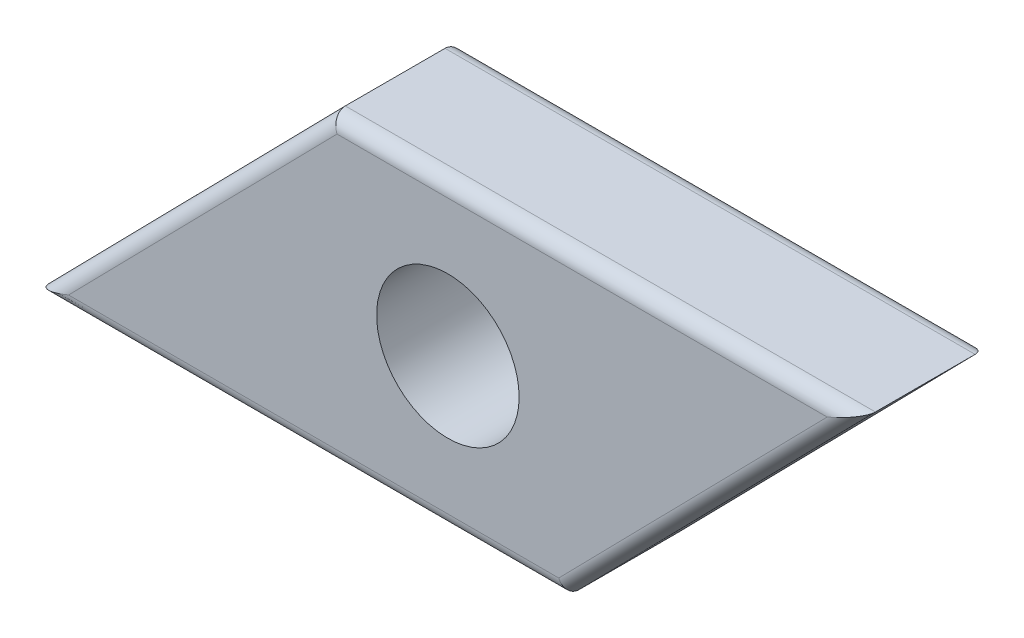
ISO-10303-21;
HEADER;
FILE_DESCRIPTION(('STEP AP214'),'2;1');
FILE_NAME('part.step','',(''),(''),'','','');
FILE_SCHEMA(('AUTOMOTIVE_DESIGN { 1 0 10303 214 1 1 1 1 }'));
ENDSEC;
DATA;
#1=APPLICATION_CONTEXT('core data for automotive mechanical design processes');
#2=APPLICATION_PROTOCOL_DEFINITION('international standard','automotive_design',2000,#1);
#3=PRODUCT_CONTEXT('',#1,'mechanical');
#4=PRODUCT('Part','Part','',(#3));
#5=PRODUCT_RELATED_PRODUCT_CATEGORY('part','',(#4));
#6=PRODUCT_DEFINITION_FORMATION('','',#4);
#7=PRODUCT_DEFINITION_CONTEXT('part definition',#1,'design');
#8=PRODUCT_DEFINITION('design','',#6,#7);
#9=PRODUCT_DEFINITION_SHAPE('','',#8);
#10=(LENGTH_UNIT() NAMED_UNIT(*) SI_UNIT(.MILLI.,.METRE.));
#11=(NAMED_UNIT(*) PLANE_ANGLE_UNIT() SI_UNIT($,.RADIAN.));
#12=(NAMED_UNIT(*) SI_UNIT($,.STERADIAN.) SOLID_ANGLE_UNIT());
#13=UNCERTAINTY_MEASURE_WITH_UNIT(LENGTH_MEASURE(1.E-05),#10,'distance_accuracy_value','');
#14=(GEOMETRIC_REPRESENTATION_CONTEXT(3) GLOBAL_UNCERTAINTY_ASSIGNED_CONTEXT((#13)) GLOBAL_UNIT_ASSIGNED_CONTEXT((#10,
#11,#12)) REPRESENTATION_CONTEXT('',''));
#15=CARTESIAN_POINT('',(0.,0.,0.));
#16=DIRECTION('',(0.,0.,1.));
#17=DIRECTION('',(1.,0.,0.));
#18=AXIS2_PLACEMENT_3D('',#15,#16,#17);
#19=CARTESIAN_POINT('',(0.,0.,4.5));
#20=DIRECTION('',(0.,0.,-1.));
#21=DIRECTION('',(-1.,0.,0.));
#22=AXIS2_PLACEMENT_3D('',#19,#20,#21);
#23=PLANE('',#22);
#24=DIRECTION('',(1.,0.,0.));
#25=VECTOR('',#24,1.);
#26=CARTESIAN_POINT('',(0.,-4.8,4.5));
#27=LINE('',#26,#25);
#28=CARTESIAN_POINT('',(-13.308966234685,-4.8,4.5));
#29=VERTEX_POINT('',#28);
#30=CARTESIAN_POINT('',(3.89009831015675,-4.8,4.5));
#31=VERTEX_POINT('',#30);
#32=EDGE_CURVE('E115',#29,#31,#27,.T.);
#33=ORIENTED_EDGE('',*,*,#32,.T.);
#34=DIRECTION('',(0.700340670128076,0.713808759938233,0.));
#35=VECTOR('',#34,1.);
#36=CARTESIAN_POINT('',(4.38165901564127,-4.29898620402539,4.5));
#37=LINE('',#36,#35);
#38=CARTESIAN_POINT('',(13.308966234685,4.8,4.5));
#39=VERTEX_POINT('',#38);
#40=EDGE_CURVE('E9',#31,#39,#37,.T.);
#41=ORIENTED_EDGE('',*,*,#40,.T.);
#42=DIRECTION('',(-1.,0.,0.));
#43=VECTOR('',#42,1.);
#44=CARTESIAN_POINT('',(0.,4.8,4.5));
#45=LINE('',#44,#43);
#46=CARTESIAN_POINT('',(-3.89009831015673,4.8,4.5));
#47=VERTEX_POINT('',#46);
#48=EDGE_CURVE('E24',#39,#47,#45,.T.);
#49=ORIENTED_EDGE('',*,*,#48,.T.);
#50=DIRECTION('',(-0.700340670128077,-0.713808759938232,0.));
#51=VECTOR('',#50,1.);
#52=CARTESIAN_POINT('',(-4.38165901564126,4.29898620402539,4.5));
#53=LINE('',#52,#51);
#54=EDGE_CURVE('E133',#47,#29,#53,.T.);
#55=ORIENTED_EDGE('',*,*,#54,.T.);
#56=EDGE_LOOP('',(#33,#41,#49,#55));
#57=FACE_BOUND('',#56,.T.);
#58=CARTESIAN_POINT('',(0.,0.,4.5));
#59=DIRECTION('',(0.,0.,1.));
#60=DIRECTION('',(1.,0.,0.));
#61=AXIS2_PLACEMENT_3D('',#58,#59,#60);
#62=CIRCLE('',#61,2.5);
#63=CARTESIAN_POINT('',(2.5,0.,4.5));
#64=VERTEX_POINT('',#63);
#65=EDGE_CURVE('E160',#64,#64,#62,.T.);
#66=ORIENTED_EDGE('',*,*,#65,.F.);
#67=EDGE_LOOP('',(#66));
#68=FACE_BOUND('',#67,.T.);
#69=ADVANCED_FACE('F15',(#57,#68),#23,.F.);
#70=CARTESIAN_POINT('',(0.,0.,0.));
#71=DIRECTION('',(0.,0.,-1.));
#72=DIRECTION('',(-1.,0.,0.));
#73=AXIS2_PLACEMENT_3D('',#70,#71,#72);
#74=PLANE('',#73);
#75=DIRECTION('',(1.,0.,0.));
#76=VECTOR('',#75,1.);
#77=CARTESIAN_POINT('',(-14.5,-4.8,0.));
#78=LINE('',#77,#76);
#79=CARTESIAN_POINT('',(3.89009831015675,-4.8,0.));
#80=VERTEX_POINT('',#79);
#81=CARTESIAN_POINT('',(-13.308966234685,-4.8,0.));
#82=VERTEX_POINT('',#81);
#83=EDGE_CURVE('E151',#80,#82,#78,.F.);
#84=ORIENTED_EDGE('',*,*,#83,.T.);
#85=DIRECTION('',(-0.700340670128077,-0.713808759938232,0.));
#86=VECTOR('',#85,1.);
#87=CARTESIAN_POINT('',(-3.74309562003089,4.94982966493596,0.));
#88=LINE('',#87,#86);
#89=CARTESIAN_POINT('',(-3.89009831015673,4.8,0.));
#90=VERTEX_POINT('',#89);
#91=EDGE_CURVE('E144',#82,#90,#88,.F.);
#92=ORIENTED_EDGE('',*,*,#91,.T.);
#93=DIRECTION('',(-1.,0.,0.));
#94=VECTOR('',#93,1.);
#95=CARTESIAN_POINT('',(14.5,4.8,0.));
#96=LINE('',#95,#94);
#97=CARTESIAN_POINT('',(13.308966234685,4.8,0.));
#98=VERTEX_POINT('',#97);
#99=EDGE_CURVE('E147',#90,#98,#96,.F.);
#100=ORIENTED_EDGE('',*,*,#99,.T.);
#101=DIRECTION('',(0.700340670128076,0.713808759938233,0.));
#102=VECTOR('',#101,1.);
#103=CARTESIAN_POINT('',(3.74309562003089,-4.94982966493597,0.));
#104=LINE('',#103,#102);
#105=EDGE_CURVE('E149',#98,#80,#104,.F.);
#106=ORIENTED_EDGE('',*,*,#105,.T.);
#107=EDGE_LOOP('',(#84,#92,#100,#106));
#108=FACE_BOUND('',#107,.T.);
#109=CARTESIAN_POINT('',(0.,0.,0.));
#110=DIRECTION('',(0.,0.,1.));
#111=DIRECTION('',(1.,0.,0.));
#112=AXIS2_PLACEMENT_3D('',#109,#110,#111);
#113=CIRCLE('',#112,2.5);
#114=CARTESIAN_POINT('',(2.5,0.,0.));
#115=VERTEX_POINT('',#114);
#116=EDGE_CURVE('E127',#115,#115,#113,.T.);
#117=ORIENTED_EDGE('',*,*,#116,.T.);
#118=EDGE_LOOP('',(#117));
#119=FACE_BOUND('',#118,.T.);
#120=ADVANCED_FACE('F170',(#108,#119),#74,.T.);
#121=CARTESIAN_POINT('',(-14.5,-5.3,4.5));
#122=DIRECTION('',(0.713808759938232,-0.700340670128077,0.));
#123=DIRECTION('',(0.700340670128077,0.713808759938232,0.));
#124=AXIS2_PLACEMENT_3D('',#121,#122,#123);
#125=PLANE('',#124);
#126=DIRECTION('',(0.,0.,-1.));
#127=VECTOR('',#126,1.);
#128=CARTESIAN_POINT('',(-4.1,5.3,4.5));
#129=LINE('',#128,#127);
#130=CARTESIAN_POINT('',(-4.1,5.3,4.));
#131=VERTEX_POINT('',#130);
#132=CARTESIAN_POINT('',(-4.1,5.3,0.5));
#133=VERTEX_POINT('',#132);
#134=EDGE_CURVE('E158',#131,#133,#129,.T.);
#135=ORIENTED_EDGE('',*,*,#134,.T.);
#136=DIRECTION('',(-0.700340670128077,-0.713808759938232,0.));
#137=VECTOR('',#136,1.);
#138=CARTESIAN_POINT('',(-14.5,-5.3,0.5));
#139=LINE('',#138,#137);
#140=CARTESIAN_POINT('',(-14.5,-5.3,0.5));
#141=VERTEX_POINT('',#140);
#142=EDGE_CURVE('E104',#133,#141,#139,.T.);
#143=ORIENTED_EDGE('',*,*,#142,.T.);
#144=DIRECTION('',(0.,0.,-1.));
#145=VECTOR('',#144,1.);
#146=CARTESIAN_POINT('',(-14.5,-5.3,4.5));
#147=LINE('',#146,#145);
#148=CARTESIAN_POINT('',(-14.5,-5.3,4.));
#149=VERTEX_POINT('',#148);
#150=EDGE_CURVE('E86',#149,#141,#147,.T.);
#151=ORIENTED_EDGE('',*,*,#150,.F.);
#152=DIRECTION('',(-0.700340670128077,-0.713808759938232,0.));
#153=VECTOR('',#152,1.);
#154=CARTESIAN_POINT('',(-14.5,-5.3,4.));
#155=LINE('',#154,#153);
#156=EDGE_CURVE('E101',#149,#131,#155,.F.);
#157=ORIENTED_EDGE('',*,*,#156,.T.);
#158=EDGE_LOOP('',(#135,#143,#151,#157));
#159=FACE_BOUND('',#158,.T.);
#160=ADVANCED_FACE('F100',(#159),#125,.F.);
#161=CARTESIAN_POINT('',(4.10000000000001,-5.3,4.5));
#162=DIRECTION('',(0.,1.,0.));
#163=DIRECTION('',(0.,0.,1.));
#164=AXIS2_PLACEMENT_3D('',#161,#162,#163);
#165=PLANE('',#164);
#166=ORIENTED_EDGE('',*,*,#150,.T.);
#167=DIRECTION('',(1.,0.,0.));
#168=VECTOR('',#167,1.);
#169=CARTESIAN_POINT('',(4.10000000000001,-5.3,0.5));
#170=LINE('',#169,#168);
#171=CARTESIAN_POINT('',(4.10000000000001,-5.3,0.5));
#172=VERTEX_POINT('',#171);
#173=EDGE_CURVE('E93',#141,#172,#170,.T.);
#174=ORIENTED_EDGE('',*,*,#173,.T.);
#175=DIRECTION('',(0.,0.,-1.));
#176=VECTOR('',#175,1.);
#177=CARTESIAN_POINT('',(4.10000000000001,-5.3,4.5));
#178=LINE('',#177,#176);
#179=CARTESIAN_POINT('',(4.10000000000001,-5.3,4.));
#180=VERTEX_POINT('',#179);
#181=EDGE_CURVE('E88',#180,#172,#178,.T.);
#182=ORIENTED_EDGE('',*,*,#181,.F.);
#183=DIRECTION('',(1.,0.,0.));
#184=VECTOR('',#183,1.);
#185=CARTESIAN_POINT('',(4.10000000000001,-5.3,4.));
#186=LINE('',#185,#184);
#187=EDGE_CURVE('E83',#180,#149,#186,.F.);
#188=ORIENTED_EDGE('',*,*,#187,.T.);
#189=EDGE_LOOP('',(#166,#174,#182,#188));
#190=FACE_BOUND('',#189,.T.);
#191=ADVANCED_FACE('F85',(#190),#165,.F.);
#192=CARTESIAN_POINT('',(14.5,5.3,4.5));
#193=DIRECTION('',(-0.713808759938232,0.700340670128076,0.));
#194=DIRECTION('',(-0.700340670128076,-0.713808759938233,0.));
#195=AXIS2_PLACEMENT_3D('',#192,#193,#194);
#196=PLANE('',#195);
#197=ORIENTED_EDGE('',*,*,#181,.T.);
#198=DIRECTION('',(0.700340670128076,0.713808759938233,0.));
#199=VECTOR('',#198,1.);
#200=CARTESIAN_POINT('',(14.5,5.3,0.5));
#201=LINE('',#200,#199);
#202=CARTESIAN_POINT('',(14.5,5.3,0.5));
#203=VERTEX_POINT('',#202);
#204=EDGE_CURVE('E94',#172,#203,#201,.T.);
#205=ORIENTED_EDGE('',*,*,#204,.T.);
#206=DIRECTION('',(0.,0.,-1.));
#207=VECTOR('',#206,1.);
#208=CARTESIAN_POINT('',(14.5,5.3,4.5));
#209=LINE('',#208,#207);
#210=CARTESIAN_POINT('',(14.5,5.3,4.));
#211=VERTEX_POINT('',#210);
#212=EDGE_CURVE('E155',#211,#203,#209,.T.);
#213=ORIENTED_EDGE('',*,*,#212,.F.);
#214=DIRECTION('',(0.700340670128076,0.713808759938233,0.));
#215=VECTOR('',#214,1.);
#216=CARTESIAN_POINT('',(14.5,5.3,4.));
#217=LINE('',#216,#215);
#218=EDGE_CURVE('E138',#211,#180,#217,.F.);
#219=ORIENTED_EDGE('',*,*,#218,.T.);
#220=EDGE_LOOP('',(#197,#205,#213,#219));
#221=FACE_BOUND('',#220,.T.);
#222=ADVANCED_FACE('F183',(#221),#196,.F.);
#223=CARTESIAN_POINT('',(-4.1,5.3,4.5));
#224=DIRECTION('',(0.,-1.,0.));
#225=DIRECTION('',(0.,0.,-1.));
#226=AXIS2_PLACEMENT_3D('',#223,#224,#225);
#227=PLANE('',#226);
#228=ORIENTED_EDGE('',*,*,#212,.T.);
#229=DIRECTION('',(-1.,0.,0.));
#230=VECTOR('',#229,1.);
#231=CARTESIAN_POINT('',(-4.1,5.3,0.5));
#232=LINE('',#231,#230);
#233=EDGE_CURVE('E140',#203,#133,#232,.T.);
#234=ORIENTED_EDGE('',*,*,#233,.T.);
#235=ORIENTED_EDGE('',*,*,#134,.F.);
#236=DIRECTION('',(-1.,0.,0.));
#237=VECTOR('',#236,1.);
#238=CARTESIAN_POINT('',(-4.1,5.3,4.));
#239=LINE('',#238,#237);
#240=EDGE_CURVE('E142',#131,#211,#239,.F.);
#241=ORIENTED_EDGE('',*,*,#240,.T.);
#242=EDGE_LOOP('',(#228,#234,#235,#241));
#243=FACE_BOUND('',#242,.T.);
#244=ADVANCED_FACE('F180',(#243),#227,.F.);
#245=CARTESIAN_POINT('',(0.,0.,4.5));
#246=DIRECTION('',(0.,0.,-1.));
#247=DIRECTION('',(-1.,0.,0.));
#248=AXIS2_PLACEMENT_3D('',#245,#246,#247);
#249=CYLINDRICAL_SURFACE('',#248,2.5);
#250=ORIENTED_EDGE('',*,*,#65,.T.);
#251=EDGE_LOOP('',(#250));
#252=FACE_BOUND('',#251,.T.);
#253=ORIENTED_EDGE('',*,*,#116,.F.);
#254=EDGE_LOOP('',(#253));
#255=FACE_BOUND('',#254,.T.);
#256=ADVANCED_FACE('F166',(#252,#255),#249,.F.);
#257=CARTESIAN_POINT('',(14.1430956200309,5.65017033506404,0.5));
#258=DIRECTION('',(-0.700340670128076,-0.713808759938233,0.));
#259=DIRECTION('',(0.713808759938233,-0.700340670128076,0.));
#260=AXIS2_PLACEMENT_3D('',#257,#258,#259);
#261=CYLINDRICAL_SURFACE('',#260,0.5);
#262=CARTESIAN_POINT('',(3.89009831015674,-4.8,0.5));
#263=DIRECTION('',(-0.922046818260352,-0.387078370534911,0.));
#264=DIRECTION('',(-0.387078370534911,0.922046818260352,0.));
#265=AXIS2_PLACEMENT_3D('',#262,#263,#264);
#266=ELLIPSE('',#265,0.542271813207232,0.5);
#267=EDGE_CURVE('E128',#80,#172,#266,.T.);
#268=ORIENTED_EDGE('',*,*,#267,.F.);
#269=ORIENTED_EDGE('',*,*,#105,.F.);
#270=CARTESIAN_POINT('',(13.308966234685,4.8,0.5));
#271=DIRECTION('',(0.387078370534911,-0.922046818260352,0.));
#272=DIRECTION('',(-0.922046818260352,-0.387078370534911,0.));
#273=AXIS2_PLACEMENT_3D('',#270,#271,#272);
#274=ELLIPSE('',#273,1.29172807901676,0.5);
#275=EDGE_CURVE('E124',#203,#98,#274,.F.);
#276=ORIENTED_EDGE('',*,*,#275,.F.);
#277=ORIENTED_EDGE('',*,*,#204,.F.);
#278=EDGE_LOOP('',(#268,#269,#276,#277));
#279=FACE_BOUND('',#278,.T.);
#280=ADVANCED_FACE('F203',(#279),#261,.T.);
#281=CARTESIAN_POINT('',(-4.1,4.8,0.5));
#282=DIRECTION('',(1.,0.,0.));
#283=DIRECTION('',(0.,0.,-1.));
#284=AXIS2_PLACEMENT_3D('',#281,#282,#283);
#285=CYLINDRICAL_SURFACE('',#284,0.5);
#286=ORIENTED_EDGE('',*,*,#275,.T.);
#287=ORIENTED_EDGE('',*,*,#99,.F.);
#288=CARTESIAN_POINT('',(-3.89009831015673,4.8,0.5));
#289=DIRECTION('',(0.922046818260352,0.387078370534911,0.));
#290=DIRECTION('',(0.387078370534911,-0.922046818260352,0.));
#291=AXIS2_PLACEMENT_3D('',#288,#289,#290);
#292=ELLIPSE('',#291,0.542271813207232,0.5);
#293=EDGE_CURVE('E117',#133,#90,#292,.F.);
#294=ORIENTED_EDGE('',*,*,#293,.F.);
#295=ORIENTED_EDGE('',*,*,#233,.F.);
#296=EDGE_LOOP('',(#286,#287,#294,#295));
#297=FACE_BOUND('',#296,.T.);
#298=ADVANCED_FACE('F199',(#297),#285,.T.);
#299=CARTESIAN_POINT('',(4.10000000000001,-4.8,0.5));
#300=DIRECTION('',(-1.,0.,0.));
#301=DIRECTION('',(0.,0.,1.));
#302=AXIS2_PLACEMENT_3D('',#299,#300,#301);
#303=CYLINDRICAL_SURFACE('',#302,0.5);
#304=ORIENTED_EDGE('',*,*,#267,.T.);
#305=ORIENTED_EDGE('',*,*,#173,.F.);
#306=CARTESIAN_POINT('',(-13.308966234685,-4.8,0.5));
#307=DIRECTION('',(-0.387078370534911,0.922046818260352,0.));
#308=DIRECTION('',(-0.922046818260352,-0.387078370534911,0.));
#309=AXIS2_PLACEMENT_3D('',#306,#307,#308);
#310=ELLIPSE('',#309,1.29172807901677,0.5);
#311=EDGE_CURVE('E116',#82,#141,#310,.T.);
#312=ORIENTED_EDGE('',*,*,#311,.F.);
#313=ORIENTED_EDGE('',*,*,#83,.F.);
#314=EDGE_LOOP('',(#304,#305,#312,#313));
#315=FACE_BOUND('',#314,.T.);
#316=ADVANCED_FACE('F195',(#315),#303,.T.);
#317=CARTESIAN_POINT('',(-14.1430956200309,-5.65017033506404,0.5));
#318=DIRECTION('',(0.700340670128077,0.713808759938232,0.));
#319=DIRECTION('',(-0.713808759938232,0.700340670128077,0.));
#320=AXIS2_PLACEMENT_3D('',#317,#318,#319);
#321=CYLINDRICAL_SURFACE('',#320,0.5);
#322=ORIENTED_EDGE('',*,*,#293,.T.);
#323=ORIENTED_EDGE('',*,*,#91,.F.);
#324=ORIENTED_EDGE('',*,*,#311,.T.);
#325=ORIENTED_EDGE('',*,*,#142,.F.);
#326=EDGE_LOOP('',(#322,#323,#324,#325));
#327=FACE_BOUND('',#326,.T.);
#328=ADVANCED_FACE('F192',(#327),#321,.T.);
#329=CARTESIAN_POINT('',(-4.38165901564126,4.29898620402539,4.));
#330=DIRECTION('',(-0.700340670128077,-0.713808759938232,0.));
#331=DIRECTION('',(0.713808759938232,-0.700340670128077,0.));
#332=AXIS2_PLACEMENT_3D('',#329,#330,#331);
#333=CYLINDRICAL_SURFACE('',#332,0.5);
#334=CARTESIAN_POINT('',(-3.89009831015673,4.8,4.));
#335=DIRECTION('',(-0.922046818260352,-0.387078370534911,0.));
#336=DIRECTION('',(0.387078370534911,-0.922046818260352,0.));
#337=AXIS2_PLACEMENT_3D('',#334,#335,#336);
#338=ELLIPSE('',#337,0.542271813207232,0.5);
#339=EDGE_CURVE('E111',#131,#47,#338,.F.);
#340=ORIENTED_EDGE('',*,*,#339,.F.);
#341=ORIENTED_EDGE('',*,*,#156,.F.);
#342=CARTESIAN_POINT('',(-13.308966234685,-4.8,4.));
#343=DIRECTION('',(0.387078370534911,-0.922046818260352,0.));
#344=DIRECTION('',(0.922046818260352,0.387078370534911,0.));
#345=AXIS2_PLACEMENT_3D('',#342,#343,#344);
#346=ELLIPSE('',#345,1.29172807901677,0.5);
#347=EDGE_CURVE('E19',#29,#149,#346,.T.);
#348=ORIENTED_EDGE('',*,*,#347,.F.);
#349=ORIENTED_EDGE('',*,*,#54,.F.);
#350=EDGE_LOOP('',(#340,#341,#348,#349));
#351=FACE_BOUND('',#350,.T.);
#352=ADVANCED_FACE('F17',(#351),#333,.T.);
#353=CARTESIAN_POINT('',(0.,-4.8,4.));
#354=DIRECTION('',(1.,0.,0.));
#355=DIRECTION('',(0.,0.,-1.));
#356=AXIS2_PLACEMENT_3D('',#353,#354,#355);
#357=CYLINDRICAL_SURFACE('',#356,0.5);
#358=ORIENTED_EDGE('',*,*,#347,.T.);
#359=ORIENTED_EDGE('',*,*,#187,.F.);
#360=CARTESIAN_POINT('',(3.89009831015675,-4.8,4.));
#361=DIRECTION('',(0.922046818260352,0.387078370534911,0.));
#362=DIRECTION('',(0.387078370534911,-0.922046818260352,0.));
#363=AXIS2_PLACEMENT_3D('',#360,#361,#362);
#364=ELLIPSE('',#363,0.542271813207232,0.5);
#365=EDGE_CURVE('E119',#31,#180,#364,.T.);
#366=ORIENTED_EDGE('',*,*,#365,.F.);
#367=ORIENTED_EDGE('',*,*,#32,.F.);
#368=EDGE_LOOP('',(#358,#359,#366,#367));
#369=FACE_BOUND('',#368,.T.);
#370=ADVANCED_FACE('F114',(#369),#357,.T.);
#371=CARTESIAN_POINT('',(0.,4.8,4.));
#372=DIRECTION('',(-1.,0.,0.));
#373=DIRECTION('',(0.,0.,1.));
#374=AXIS2_PLACEMENT_3D('',#371,#372,#373);
#375=CYLINDRICAL_SURFACE('',#374,0.5);
#376=ORIENTED_EDGE('',*,*,#339,.T.);
#377=ORIENTED_EDGE('',*,*,#48,.F.);
#378=CARTESIAN_POINT('',(13.308966234685,4.8,4.));
#379=DIRECTION('',(-0.387078370534911,0.922046818260352,0.));
#380=DIRECTION('',(-0.922046818260352,-0.387078370534911,0.));
#381=AXIS2_PLACEMENT_3D('',#378,#379,#380);
#382=ELLIPSE('',#381,1.29172807901676,0.5);
#383=EDGE_CURVE('E32',#211,#39,#382,.F.);
#384=ORIENTED_EDGE('',*,*,#383,.F.);
#385=ORIENTED_EDGE('',*,*,#240,.F.);
#386=EDGE_LOOP('',(#376,#377,#384,#385));
#387=FACE_BOUND('',#386,.T.);
#388=ADVANCED_FACE('F211',(#387),#375,.T.);
#389=CARTESIAN_POINT('',(4.38165901564127,-4.29898620402539,4.));
#390=DIRECTION('',(0.700340670128076,0.713808759938233,0.));
#391=DIRECTION('',(-0.713808759938233,0.700340670128076,0.));
#392=AXIS2_PLACEMENT_3D('',#389,#390,#391);
#393=CYLINDRICAL_SURFACE('',#392,0.5);
#394=ORIENTED_EDGE('',*,*,#365,.T.);
#395=ORIENTED_EDGE('',*,*,#218,.F.);
#396=ORIENTED_EDGE('',*,*,#383,.T.);
#397=ORIENTED_EDGE('',*,*,#40,.F.);
#398=EDGE_LOOP('',(#394,#395,#396,#397));
#399=FACE_BOUND('',#398,.T.);
#400=ADVANCED_FACE('F208',(#399),#393,.T.);
#401=CLOSED_SHELL('',(#69,#120,#160,#191,#222,#244,#256,#280,#298,#316,#328,#352,#370,#388,#400));
#402=MANIFOLD_SOLID_BREP('B1',#401);
#403=ADVANCED_BREP_SHAPE_REPRESENTATION('',(#18,#402),#14);
#404=SHAPE_DEFINITION_REPRESENTATION(#9,#403);
ENDSEC;
END-ISO-10303-21;
